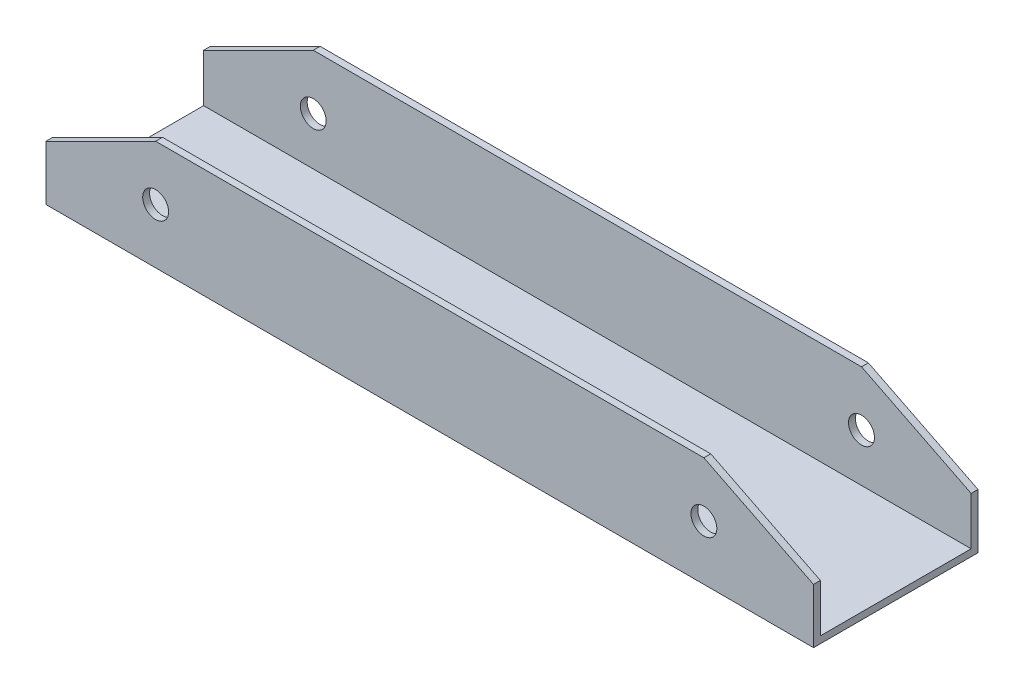
ISO-10303-21;
HEADER;
FILE_DESCRIPTION(('STEP AP214'),'2;1');
FILE_NAME('part.step','',(''),(''),'','','');
FILE_SCHEMA(('AUTOMOTIVE_DESIGN { 1 0 10303 214 1 1 1 1 }'));
ENDSEC;
DATA;
#1=APPLICATION_CONTEXT('core data for automotive mechanical design processes');
#2=APPLICATION_PROTOCOL_DEFINITION('international standard','automotive_design',2000,#1);
#3=PRODUCT_CONTEXT('',#1,'mechanical');
#4=PRODUCT('Part','Part','',(#3));
#5=PRODUCT_RELATED_PRODUCT_CATEGORY('part','',(#4));
#6=PRODUCT_DEFINITION_FORMATION('','',#4);
#7=PRODUCT_DEFINITION_CONTEXT('part definition',#1,'design');
#8=PRODUCT_DEFINITION('design','',#6,#7);
#9=PRODUCT_DEFINITION_SHAPE('','',#8);
#10=(LENGTH_UNIT() NAMED_UNIT(*) SI_UNIT(.MILLI.,.METRE.));
#11=(NAMED_UNIT(*) PLANE_ANGLE_UNIT() SI_UNIT($,.RADIAN.));
#12=(NAMED_UNIT(*) SI_UNIT($,.STERADIAN.) SOLID_ANGLE_UNIT());
#13=UNCERTAINTY_MEASURE_WITH_UNIT(LENGTH_MEASURE(1.E-05),#10,'distance_accuracy_value','');
#14=(GEOMETRIC_REPRESENTATION_CONTEXT(3) GLOBAL_UNCERTAINTY_ASSIGNED_CONTEXT((#13)) GLOBAL_UNIT_ASSIGNED_CONTEXT((#10,
#11,#12)) REPRESENTATION_CONTEXT('',''));
#15=CARTESIAN_POINT('',(0.,0.,0.));
#16=DIRECTION('',(0.,0.,1.));
#17=DIRECTION('',(1.,0.,0.));
#18=AXIS2_PLACEMENT_3D('',#15,#16,#17);
#19=CARTESIAN_POINT('',(0.,0.,0.));
#20=DIRECTION('',(-1.,0.,0.));
#21=DIRECTION('',(0.,0.,1.));
#22=AXIS2_PLACEMENT_3D('',#19,#20,#21);
#23=PLANE('',#22);
#24=DIRECTION('',(0.,0.,1.));
#25=VECTOR('',#24,1.);
#26=CARTESIAN_POINT('',(0.,12.7,-228.6));
#27=LINE('',#26,#25);
#28=CARTESIAN_POINT('',(0.,12.7,-38.1));
#29=VERTEX_POINT('',#28);
#30=CARTESIAN_POINT('',(0.,12.7,-36.5125));
#31=VERTEX_POINT('',#30);
#32=EDGE_CURVE('E51',#29,#31,#27,.T.);
#33=ORIENTED_EDGE('',*,*,#32,.F.);
#34=DIRECTION('',(0.,1.,0.));
#35=VECTOR('',#34,1.);
#36=CARTESIAN_POINT('',(0.,0.,-38.1));
#37=LINE('',#36,#35);
#38=CARTESIAN_POINT('',(0.,0.,-38.1));
#39=VERTEX_POINT('',#38);
#40=EDGE_CURVE('E153',#39,#29,#37,.T.);
#41=ORIENTED_EDGE('',*,*,#40,.F.);
#42=DIRECTION('',(0.,0.,-1.));
#43=VECTOR('',#42,1.);
#44=CARTESIAN_POINT('',(0.,0.,0.));
#45=LINE('',#44,#43);
#46=CARTESIAN_POINT('',(0.,0.,0.));
#47=VERTEX_POINT('',#46);
#48=EDGE_CURVE('E150',#47,#39,#45,.T.);
#49=ORIENTED_EDGE('',*,*,#48,.F.);
#50=DIRECTION('',(0.,-1.,0.));
#51=VECTOR('',#50,1.);
#52=CARTESIAN_POINT('',(0.,0.,0.));
#53=LINE('',#52,#51);
#54=CARTESIAN_POINT('',(0.,12.7,0.));
#55=VERTEX_POINT('',#54);
#56=EDGE_CURVE('E141',#55,#47,#53,.T.);
#57=ORIENTED_EDGE('',*,*,#56,.F.);
#58=CARTESIAN_POINT('',(0.,12.7,-1.58749999999999));
#59=VERTEX_POINT('',#58);
#60=EDGE_CURVE('E126',#59,#55,#27,.T.);
#61=ORIENTED_EDGE('',*,*,#60,.F.);
#62=DIRECTION('',(0.,-1.,0.));
#63=VECTOR('',#62,1.);
#64=CARTESIAN_POINT('',(0.,1.5875,-1.5875));
#65=LINE('',#64,#63);
#66=CARTESIAN_POINT('',(0.,1.5875,-1.5875));
#67=VERTEX_POINT('',#66);
#68=EDGE_CURVE('E192',#59,#67,#65,.T.);
#69=ORIENTED_EDGE('',*,*,#68,.T.);
#70=DIRECTION('',(0.,0.,-1.));
#71=VECTOR('',#70,1.);
#72=CARTESIAN_POINT('',(0.,1.5875,-1.5875));
#73=LINE('',#72,#71);
#74=CARTESIAN_POINT('',(0.,1.5875,-36.5125));
#75=VERTEX_POINT('',#74);
#76=EDGE_CURVE('E194',#67,#75,#73,.T.);
#77=ORIENTED_EDGE('',*,*,#76,.T.);
#78=DIRECTION('',(0.,1.,0.));
#79=VECTOR('',#78,1.);
#80=CARTESIAN_POINT('',(0.,1.5875,-36.5125));
#81=LINE('',#80,#79);
#82=EDGE_CURVE('E197',#75,#31,#81,.T.);
#83=ORIENTED_EDGE('',*,*,#82,.T.);
#84=EDGE_LOOP('',(#33,#41,#49,#57,#61,#69,#77,#83));
#85=FACE_BOUND('',#84,.T.);
#86=ADVANCED_FACE('F34',(#85),#23,.T.);
#87=CARTESIAN_POINT('',(228.6,0.,0.));
#88=DIRECTION('',(0.,0.,-1.));
#89=DIRECTION('',(-1.,0.,0.));
#90=AXIS2_PLACEMENT_3D('',#87,#88,#89);
#91=PLANE('',#90);
#92=CARTESIAN_POINT('',(152.4,12.7,0.));
#93=DIRECTION('',(0.,0.,1.));
#94=DIRECTION('',(1.,0.,0.));
#95=AXIS2_PLACEMENT_3D('',#92,#93,#94);
#96=CIRCLE('',#95,2.99999999999999);
#97=CARTESIAN_POINT('',(155.4,12.7,0.));
#98=VERTEX_POINT('',#97);
#99=EDGE_CURVE('E267',#98,#98,#96,.T.);
#100=ORIENTED_EDGE('',*,*,#99,.F.);
#101=EDGE_LOOP('',(#100));
#102=FACE_BOUND('',#101,.T.);
#103=CARTESIAN_POINT('',(25.4,12.7,0.));
#104=DIRECTION('',(0.,0.,1.));
#105=DIRECTION('',(1.,0.,0.));
#106=AXIS2_PLACEMENT_3D('',#103,#104,#105);
#107=CIRCLE('',#106,3.);
#108=CARTESIAN_POINT('',(28.4,12.7,0.));
#109=VERTEX_POINT('',#108);
#110=EDGE_CURVE('E146',#109,#109,#107,.T.);
#111=ORIENTED_EDGE('',*,*,#110,.F.);
#112=EDGE_LOOP('',(#111));
#113=FACE_BOUND('',#112,.T.);
#114=DIRECTION('',(-1.,0.,0.));
#115=VECTOR('',#114,1.);
#116=CARTESIAN_POINT('',(228.6,0.,0.));
#117=LINE('',#116,#115);
#118=CARTESIAN_POINT('',(177.8,0.,0.));
#119=VERTEX_POINT('',#118);
#120=EDGE_CURVE('E162',#119,#47,#117,.T.);
#121=ORIENTED_EDGE('',*,*,#120,.F.);
#122=DIRECTION('',(0.,-1.,0.));
#123=VECTOR('',#122,1.);
#124=CARTESIAN_POINT('',(177.8,12.7,0.));
#125=LINE('',#124,#123);
#126=CARTESIAN_POINT('',(177.8,12.7,0.));
#127=VERTEX_POINT('',#126);
#128=EDGE_CURVE('E137',#127,#119,#125,.T.);
#129=ORIENTED_EDGE('',*,*,#128,.F.);
#130=DIRECTION('',(0.894427190999916,-0.447213595499958,0.));
#131=VECTOR('',#130,1.);
#132=CARTESIAN_POINT('',(152.4,25.4,0.));
#133=LINE('',#132,#131);
#134=CARTESIAN_POINT('',(152.4,25.4,0.));
#135=VERTEX_POINT('',#134);
#136=EDGE_CURVE('E225',#135,#127,#133,.T.);
#137=ORIENTED_EDGE('',*,*,#136,.F.);
#138=DIRECTION('',(1.,0.,0.));
#139=VECTOR('',#138,1.);
#140=CARTESIAN_POINT('',(25.4,25.4,0.));
#141=LINE('',#140,#139);
#142=CARTESIAN_POINT('',(25.4,25.4,0.));
#143=VERTEX_POINT('',#142);
#144=EDGE_CURVE('E145',#143,#135,#141,.T.);
#145=ORIENTED_EDGE('',*,*,#144,.F.);
#146=DIRECTION('',(0.894427190999916,0.447213595499958,0.));
#147=VECTOR('',#146,1.);
#148=CARTESIAN_POINT('',(0.,12.7,0.));
#149=LINE('',#148,#147);
#150=EDGE_CURVE('E130',#55,#143,#149,.T.);
#151=ORIENTED_EDGE('',*,*,#150,.F.);
#152=ORIENTED_EDGE('',*,*,#56,.T.);
#153=EDGE_LOOP('',(#121,#129,#137,#145,#151,#152));
#154=FACE_BOUND('',#153,.T.);
#155=ADVANCED_FACE('F36',(#102,#113,#154),#91,.F.);
#156=CARTESIAN_POINT('',(228.6,0.,0.));
#157=DIRECTION('',(0.,1.,0.));
#158=DIRECTION('',(0.,0.,1.));
#159=AXIS2_PLACEMENT_3D('',#156,#157,#158);
#160=PLANE('',#159);
#161=DIRECTION('',(-1.,0.,0.));
#162=VECTOR('',#161,1.);
#163=CARTESIAN_POINT('',(228.6,0.,-38.1));
#164=LINE('',#163,#162);
#165=CARTESIAN_POINT('',(177.8,0.,-38.1));
#166=VERTEX_POINT('',#165);
#167=EDGE_CURVE('E59',#166,#39,#164,.T.);
#168=ORIENTED_EDGE('',*,*,#167,.F.);
#169=DIRECTION('',(0.,0.,1.));
#170=VECTOR('',#169,1.);
#171=CARTESIAN_POINT('',(177.8,0.,-228.6));
#172=LINE('',#171,#170);
#173=EDGE_CURVE('E230',#166,#119,#172,.T.);
#174=ORIENTED_EDGE('',*,*,#173,.T.);
#175=ORIENTED_EDGE('',*,*,#120,.T.);
#176=ORIENTED_EDGE('',*,*,#48,.T.);
#177=EDGE_LOOP('',(#168,#174,#175,#176));
#178=FACE_BOUND('',#177,.T.);
#179=ADVANCED_FACE('F263',(#178),#160,.F.);
#180=CARTESIAN_POINT('',(228.6,0.,-38.1));
#181=DIRECTION('',(0.,0.,1.));
#182=DIRECTION('',(0.,-1.,0.));
#183=AXIS2_PLACEMENT_3D('',#180,#181,#182);
#184=PLANE('',#183);
#185=CARTESIAN_POINT('',(152.4,12.7,-38.1));
#186=DIRECTION('',(0.,0.,1.));
#187=DIRECTION('',(0.,-1.,0.));
#188=AXIS2_PLACEMENT_3D('',#185,#186,#187);
#189=CIRCLE('',#188,2.99999999999999);
#190=CARTESIAN_POINT('',(152.4,9.7,-38.1));
#191=VERTEX_POINT('',#190);
#192=EDGE_CURVE('E189',#191,#191,#189,.T.);
#193=ORIENTED_EDGE('',*,*,#192,.T.);
#194=EDGE_LOOP('',(#193));
#195=FACE_BOUND('',#194,.T.);
#196=CARTESIAN_POINT('',(25.4,12.7,-38.1));
#197=DIRECTION('',(0.,0.,1.));
#198=DIRECTION('',(0.,-1.,0.));
#199=AXIS2_PLACEMENT_3D('',#196,#197,#198);
#200=CIRCLE('',#199,3.);
#201=CARTESIAN_POINT('',(25.4,9.7,-38.1));
#202=VERTEX_POINT('',#201);
#203=EDGE_CURVE('E175',#202,#202,#200,.T.);
#204=ORIENTED_EDGE('',*,*,#203,.T.);
#205=EDGE_LOOP('',(#204));
#206=FACE_BOUND('',#205,.T.);
#207=DIRECTION('',(0.894427190999916,-0.447213595499958,0.));
#208=VECTOR('',#207,1.);
#209=CARTESIAN_POINT('',(223.52,-10.16,-38.1));
#210=LINE('',#209,#208);
#211=CARTESIAN_POINT('',(152.4,25.4,-38.1));
#212=VERTEX_POINT('',#211);
#213=CARTESIAN_POINT('',(177.8,12.7,-38.1));
#214=VERTEX_POINT('',#213);
#215=EDGE_CURVE('E250',#212,#214,#210,.T.);
#216=ORIENTED_EDGE('',*,*,#215,.T.);
#217=DIRECTION('',(0.,-1.,0.));
#218=VECTOR('',#217,1.);
#219=CARTESIAN_POINT('',(177.8,0.,-38.1));
#220=LINE('',#219,#218);
#221=EDGE_CURVE('E171',#214,#166,#220,.T.);
#222=ORIENTED_EDGE('',*,*,#221,.T.);
#223=ORIENTED_EDGE('',*,*,#167,.T.);
#224=ORIENTED_EDGE('',*,*,#40,.T.);
#225=DIRECTION('',(0.894427190999916,0.447213595499958,0.));
#226=VECTOR('',#225,1.);
#227=CARTESIAN_POINT('',(177.8,101.6,-38.1));
#228=LINE('',#227,#226);
#229=CARTESIAN_POINT('',(25.4,25.4,-38.1));
#230=VERTEX_POINT('',#229);
#231=EDGE_CURVE('E241',#29,#230,#228,.T.);
#232=ORIENTED_EDGE('',*,*,#231,.T.);
#233=DIRECTION('',(1.,0.,0.));
#234=VECTOR('',#233,1.);
#235=CARTESIAN_POINT('',(228.6,25.4,-38.1));
#236=LINE('',#235,#234);
#237=EDGE_CURVE('E246',#230,#212,#236,.T.);
#238=ORIENTED_EDGE('',*,*,#237,.T.);
#239=EDGE_LOOP('',(#216,#222,#223,#224,#232,#238));
#240=FACE_BOUND('',#239,.T.);
#241=ADVANCED_FACE('F251',(#195,#206,#240),#184,.F.);
#242=CARTESIAN_POINT('',(228.6,1.5875,-1.5875));
#243=DIRECTION('',(0.,0.,-1.));
#244=DIRECTION('',(-1.,0.,0.));
#245=AXIS2_PLACEMENT_3D('',#242,#243,#244);
#246=PLANE('',#245);
#247=CARTESIAN_POINT('',(152.4,12.7,-1.58749999999999));
#248=DIRECTION('',(0.,0.,-1.));
#249=DIRECTION('',(-1.,0.,0.));
#250=AXIS2_PLACEMENT_3D('',#247,#248,#249);
#251=CIRCLE('',#250,2.99999999999999);
#252=CARTESIAN_POINT('',(149.4,12.7,-1.58749999999999));
#253=VERTEX_POINT('',#252);
#254=EDGE_CURVE('E186',#253,#253,#251,.T.);
#255=ORIENTED_EDGE('',*,*,#254,.F.);
#256=EDGE_LOOP('',(#255));
#257=FACE_BOUND('',#256,.T.);
#258=CARTESIAN_POINT('',(25.4,12.7,-1.58749999999999));
#259=DIRECTION('',(0.,0.,-1.));
#260=DIRECTION('',(-1.,0.,0.));
#261=AXIS2_PLACEMENT_3D('',#258,#259,#260);
#262=CIRCLE('',#261,3.);
#263=CARTESIAN_POINT('',(22.4,12.7,-1.58749999999999));
#264=VERTEX_POINT('',#263);
#265=EDGE_CURVE('E170',#264,#264,#262,.T.);
#266=ORIENTED_EDGE('',*,*,#265,.F.);
#267=EDGE_LOOP('',(#266));
#268=FACE_BOUND('',#267,.T.);
#269=DIRECTION('',(0.,1.,0.));
#270=VECTOR('',#269,1.);
#271=CARTESIAN_POINT('',(177.8,1.5875,-1.5875));
#272=LINE('',#271,#270);
#273=CARTESIAN_POINT('',(177.8,1.5875,-1.5875));
#274=VERTEX_POINT('',#273);
#275=CARTESIAN_POINT('',(177.8,12.7,-1.58749999999999));
#276=VERTEX_POINT('',#275);
#277=EDGE_CURVE('E177',#274,#276,#272,.T.);
#278=ORIENTED_EDGE('',*,*,#277,.F.);
#279=DIRECTION('',(-1.,0.,0.));
#280=VECTOR('',#279,1.);
#281=CARTESIAN_POINT('',(228.6,1.5875,-1.5875));
#282=LINE('',#281,#280);
#283=EDGE_CURVE('E151',#274,#67,#282,.T.);
#284=ORIENTED_EDGE('',*,*,#283,.T.);
#285=ORIENTED_EDGE('',*,*,#68,.F.);
#286=DIRECTION('',(-0.894427190999916,-0.447213595499958,0.));
#287=VECTOR('',#286,1.);
#288=CARTESIAN_POINT('',(178.435,101.9175,-1.5875));
#289=LINE('',#288,#287);
#290=CARTESIAN_POINT('',(25.4,25.4,-1.58749999999999));
#291=VERTEX_POINT('',#290);
#292=EDGE_CURVE('E133',#291,#59,#289,.T.);
#293=ORIENTED_EDGE('',*,*,#292,.F.);
#294=DIRECTION('',(-1.,0.,0.));
#295=VECTOR('',#294,1.);
#296=CARTESIAN_POINT('',(228.6,25.4,-1.5875));
#297=LINE('',#296,#295);
#298=CARTESIAN_POINT('',(152.4,25.4,-1.58749999999999));
#299=VERTEX_POINT('',#298);
#300=EDGE_CURVE('E244',#299,#291,#297,.T.);
#301=ORIENTED_EDGE('',*,*,#300,.F.);
#302=DIRECTION('',(-0.894427190999916,0.447213595499958,0.));
#303=VECTOR('',#302,1.);
#304=CARTESIAN_POINT('',(222.885,-9.84249999999998,-1.5875));
#305=LINE('',#304,#303);
#306=EDGE_CURVE('E215',#276,#299,#305,.T.);
#307=ORIENTED_EDGE('',*,*,#306,.F.);
#308=EDGE_LOOP('',(#278,#284,#285,#293,#301,#307));
#309=FACE_BOUND('',#308,.T.);
#310=ADVANCED_FACE('F212',(#257,#268,#309),#246,.T.);
#311=CARTESIAN_POINT('',(228.6,1.5875,-1.5875));
#312=DIRECTION('',(0.,1.,0.));
#313=DIRECTION('',(0.,0.,1.));
#314=AXIS2_PLACEMENT_3D('',#311,#312,#313);
#315=PLANE('',#314);
#316=DIRECTION('',(0.,0.,1.));
#317=VECTOR('',#316,1.);
#318=CARTESIAN_POINT('',(177.8,1.5875,-1.5875));
#319=LINE('',#318,#317);
#320=CARTESIAN_POINT('',(177.8,1.5875,-36.5125));
#321=VERTEX_POINT('',#320);
#322=EDGE_CURVE('E180',#321,#274,#319,.T.);
#323=ORIENTED_EDGE('',*,*,#322,.F.);
#324=DIRECTION('',(-1.,0.,0.));
#325=VECTOR('',#324,1.);
#326=CARTESIAN_POINT('',(228.6,1.5875,-36.5125));
#327=LINE('',#326,#325);
#328=EDGE_CURVE('E156',#321,#75,#327,.T.);
#329=ORIENTED_EDGE('',*,*,#328,.T.);
#330=ORIENTED_EDGE('',*,*,#76,.F.);
#331=ORIENTED_EDGE('',*,*,#283,.F.);
#332=EDGE_LOOP('',(#323,#329,#330,#331));
#333=FACE_BOUND('',#332,.T.);
#334=ADVANCED_FACE('F204',(#333),#315,.T.);
#335=CARTESIAN_POINT('',(228.6,1.5875,-36.5125));
#336=DIRECTION('',(0.,0.,1.));
#337=DIRECTION('',(1.,0.,0.));
#338=AXIS2_PLACEMENT_3D('',#335,#336,#337);
#339=PLANE('',#338);
#340=CARTESIAN_POINT('',(152.4,12.7,-36.5125));
#341=DIRECTION('',(0.,0.,1.));
#342=DIRECTION('',(1.,0.,0.));
#343=AXIS2_PLACEMENT_3D('',#340,#341,#342);
#344=CIRCLE('',#343,2.99999999999999);
#345=CARTESIAN_POINT('',(155.4,12.7,-36.5125));
#346=VERTEX_POINT('',#345);
#347=EDGE_CURVE('E38',#346,#346,#344,.T.);
#348=ORIENTED_EDGE('',*,*,#347,.F.);
#349=EDGE_LOOP('',(#348));
#350=FACE_BOUND('',#349,.T.);
#351=CARTESIAN_POINT('',(25.4,12.7,-36.5125));
#352=DIRECTION('',(0.,0.,1.));
#353=DIRECTION('',(1.,0.,0.));
#354=AXIS2_PLACEMENT_3D('',#351,#352,#353);
#355=CIRCLE('',#354,3.);
#356=CARTESIAN_POINT('',(28.4,12.7,-36.5125));
#357=VERTEX_POINT('',#356);
#358=EDGE_CURVE('E168',#357,#357,#355,.T.);
#359=ORIENTED_EDGE('',*,*,#358,.F.);
#360=EDGE_LOOP('',(#359));
#361=FACE_BOUND('',#360,.T.);
#362=DIRECTION('',(0.,-1.,0.));
#363=VECTOR('',#362,1.);
#364=CARTESIAN_POINT('',(177.8,1.5875,-36.5125));
#365=LINE('',#364,#363);
#366=CARTESIAN_POINT('',(177.8,12.7,-36.5125));
#367=VERTEX_POINT('',#366);
#368=EDGE_CURVE('E11',#367,#321,#365,.T.);
#369=ORIENTED_EDGE('',*,*,#368,.F.);
#370=DIRECTION('',(0.894427190999916,-0.447213595499958,0.));
#371=VECTOR('',#370,1.);
#372=CARTESIAN_POINT('',(222.885,-9.84249999999998,-36.5125));
#373=LINE('',#372,#371);
#374=CARTESIAN_POINT('',(152.4,25.4,-36.5125));
#375=VERTEX_POINT('',#374);
#376=EDGE_CURVE('E43',#375,#367,#373,.T.);
#377=ORIENTED_EDGE('',*,*,#376,.F.);
#378=DIRECTION('',(1.,0.,0.));
#379=VECTOR('',#378,1.);
#380=CARTESIAN_POINT('',(228.6,25.4,-36.5125));
#381=LINE('',#380,#379);
#382=CARTESIAN_POINT('',(25.4,25.4,-36.5125));
#383=VERTEX_POINT('',#382);
#384=EDGE_CURVE('E166',#383,#375,#381,.T.);
#385=ORIENTED_EDGE('',*,*,#384,.F.);
#386=DIRECTION('',(0.894427190999916,0.447213595499958,0.));
#387=VECTOR('',#386,1.);
#388=CARTESIAN_POINT('',(178.435,101.9175,-36.5125));
#389=LINE('',#388,#387);
#390=EDGE_CURVE('E164',#31,#383,#389,.T.);
#391=ORIENTED_EDGE('',*,*,#390,.F.);
#392=ORIENTED_EDGE('',*,*,#82,.F.);
#393=ORIENTED_EDGE('',*,*,#328,.F.);
#394=EDGE_LOOP('',(#369,#377,#385,#391,#392,#393));
#395=FACE_BOUND('',#394,.T.);
#396=ADVANCED_FACE('F208',(#350,#361,#395),#339,.T.);
#397=CARTESIAN_POINT('',(177.8,12.7,-228.6));
#398=DIRECTION('',(-1.,0.,0.));
#399=DIRECTION('',(0.,0.,1.));
#400=AXIS2_PLACEMENT_3D('',#397,#398,#399);
#401=PLANE('',#400);
#402=DIRECTION('',(0.,0.,1.));
#403=VECTOR('',#402,1.);
#404=CARTESIAN_POINT('',(177.8,12.7,-228.6));
#405=LINE('',#404,#403);
#406=EDGE_CURVE('E227',#214,#367,#405,.T.);
#407=ORIENTED_EDGE('',*,*,#406,.T.);
#408=ORIENTED_EDGE('',*,*,#368,.T.);
#409=ORIENTED_EDGE('',*,*,#322,.T.);
#410=ORIENTED_EDGE('',*,*,#277,.T.);
#411=EDGE_CURVE('E220',#276,#127,#405,.T.);
#412=ORIENTED_EDGE('',*,*,#411,.T.);
#413=ORIENTED_EDGE('',*,*,#128,.T.);
#414=ORIENTED_EDGE('',*,*,#173,.F.);
#415=ORIENTED_EDGE('',*,*,#221,.F.);
#416=EDGE_LOOP('',(#407,#408,#409,#410,#412,#413,#414,#415));
#417=FACE_BOUND('',#416,.T.);
#418=ADVANCED_FACE('F219',(#417),#401,.F.);
#419=CARTESIAN_POINT('',(152.4,25.4,-228.6));
#420=DIRECTION('',(-0.447213595499958,-0.894427190999916,0.));
#421=DIRECTION('',(0.894427190999916,-0.447213595499958,0.));
#422=AXIS2_PLACEMENT_3D('',#419,#420,#421);
#423=PLANE('',#422);
#424=DIRECTION('',(0.,0.,1.));
#425=VECTOR('',#424,1.);
#426=CARTESIAN_POINT('',(152.4,25.4,-228.6));
#427=LINE('',#426,#425);
#428=EDGE_CURVE('E228',#212,#375,#427,.T.);
#429=ORIENTED_EDGE('',*,*,#428,.T.);
#430=ORIENTED_EDGE('',*,*,#376,.T.);
#431=ORIENTED_EDGE('',*,*,#406,.F.);
#432=ORIENTED_EDGE('',*,*,#215,.F.);
#433=EDGE_LOOP('',(#429,#430,#431,#432));
#434=FACE_BOUND('',#433,.T.);
#435=ADVANCED_FACE('F255',(#434),#423,.F.);
#436=ORIENTED_EDGE('',*,*,#306,.T.);
#437=EDGE_CURVE('E232',#299,#135,#427,.T.);
#438=ORIENTED_EDGE('',*,*,#437,.T.);
#439=ORIENTED_EDGE('',*,*,#136,.T.);
#440=ORIENTED_EDGE('',*,*,#411,.F.);
#441=EDGE_LOOP('',(#436,#438,#439,#440));
#442=FACE_BOUND('',#441,.T.);
#443=ADVANCED_FACE('F223',(#442),#423,.F.);
#444=CARTESIAN_POINT('',(25.4,25.4,-228.6));
#445=DIRECTION('',(0.,-1.,0.));
#446=DIRECTION('',(0.,0.,-1.));
#447=AXIS2_PLACEMENT_3D('',#444,#445,#446);
#448=PLANE('',#447);
#449=DIRECTION('',(0.,0.,1.));
#450=VECTOR('',#449,1.);
#451=CARTESIAN_POINT('',(25.4,25.4,-228.6));
#452=LINE('',#451,#450);
#453=EDGE_CURVE('E237',#230,#383,#452,.T.);
#454=ORIENTED_EDGE('',*,*,#453,.T.);
#455=ORIENTED_EDGE('',*,*,#384,.T.);
#456=ORIENTED_EDGE('',*,*,#428,.F.);
#457=ORIENTED_EDGE('',*,*,#237,.F.);
#458=EDGE_LOOP('',(#454,#455,#456,#457));
#459=FACE_BOUND('',#458,.T.);
#460=ADVANCED_FACE('F259',(#459),#448,.F.);
#461=ORIENTED_EDGE('',*,*,#300,.T.);
#462=EDGE_CURVE('E238',#291,#143,#452,.T.);
#463=ORIENTED_EDGE('',*,*,#462,.T.);
#464=ORIENTED_EDGE('',*,*,#144,.T.);
#465=ORIENTED_EDGE('',*,*,#437,.F.);
#466=EDGE_LOOP('',(#461,#463,#464,#465));
#467=FACE_BOUND('',#466,.T.);
#468=ADVANCED_FACE('F325',(#467),#448,.F.);
#469=CARTESIAN_POINT('',(0.,12.7,-228.6));
#470=DIRECTION('',(0.447213595499958,-0.894427190999916,0.));
#471=DIRECTION('',(0.894427190999916,0.447213595499958,0.));
#472=AXIS2_PLACEMENT_3D('',#469,#470,#471);
#473=PLANE('',#472);
#474=ORIENTED_EDGE('',*,*,#32,.T.);
#475=ORIENTED_EDGE('',*,*,#390,.T.);
#476=ORIENTED_EDGE('',*,*,#453,.F.);
#477=ORIENTED_EDGE('',*,*,#231,.F.);
#478=EDGE_LOOP('',(#474,#475,#476,#477));
#479=FACE_BOUND('',#478,.T.);
#480=ADVANCED_FACE('F322',(#479),#473,.F.);
#481=ORIENTED_EDGE('',*,*,#292,.T.);
#482=ORIENTED_EDGE('',*,*,#60,.T.);
#483=ORIENTED_EDGE('',*,*,#150,.T.);
#484=ORIENTED_EDGE('',*,*,#462,.F.);
#485=EDGE_LOOP('',(#481,#482,#483,#484));
#486=FACE_BOUND('',#485,.T.);
#487=ADVANCED_FACE('F128',(#486),#473,.F.);
#488=CARTESIAN_POINT('',(25.4,12.7,-228.6));
#489=DIRECTION('',(0.,0.,1.));
#490=DIRECTION('',(1.,0.,0.));
#491=AXIS2_PLACEMENT_3D('',#488,#489,#490);
#492=CYLINDRICAL_SURFACE('',#491,3.);
#493=ORIENTED_EDGE('',*,*,#358,.T.);
#494=EDGE_LOOP('',(#493));
#495=FACE_BOUND('',#494,.T.);
#496=ORIENTED_EDGE('',*,*,#203,.F.);
#497=EDGE_LOOP('',(#496));
#498=FACE_BOUND('',#497,.T.);
#499=ADVANCED_FACE('F294',(#495,#498),#492,.F.);
#500=CARTESIAN_POINT('',(152.4,12.7,-228.6));
#501=DIRECTION('',(0.,0.,1.));
#502=DIRECTION('',(1.,0.,0.));
#503=AXIS2_PLACEMENT_3D('',#500,#501,#502);
#504=CYLINDRICAL_SURFACE('',#503,2.99999999999999);
#505=ORIENTED_EDGE('',*,*,#347,.T.);
#506=EDGE_LOOP('',(#505));
#507=FACE_BOUND('',#506,.T.);
#508=ORIENTED_EDGE('',*,*,#192,.F.);
#509=EDGE_LOOP('',(#508));
#510=FACE_BOUND('',#509,.T.);
#511=ADVANCED_FACE('F288',(#507,#510),#504,.F.);
#512=ORIENTED_EDGE('',*,*,#265,.T.);
#513=EDGE_LOOP('',(#512));
#514=FACE_BOUND('',#513,.T.);
#515=ORIENTED_EDGE('',*,*,#110,.T.);
#516=EDGE_LOOP('',(#515));
#517=FACE_BOUND('',#516,.T.);
#518=ADVANCED_FACE('F273',(#514,#517),#492,.F.);
#519=ORIENTED_EDGE('',*,*,#254,.T.);
#520=EDGE_LOOP('',(#519));
#521=FACE_BOUND('',#520,.T.);
#522=ORIENTED_EDGE('',*,*,#99,.T.);
#523=EDGE_LOOP('',(#522));
#524=FACE_BOUND('',#523,.T.);
#525=ADVANCED_FACE('F284',(#521,#524),#504,.F.);
#526=CLOSED_SHELL('',(#86,#155,#179,#241,#310,#334,#396,#418,#435,#443,#460,#468,#480,#487,#499,
#511,#518,#525));
#527=MANIFOLD_SOLID_BREP('B2',#526);
#528=ADVANCED_BREP_SHAPE_REPRESENTATION('',(#18,#527),#14);
#529=SHAPE_DEFINITION_REPRESENTATION(#9,#528);
ENDSEC;
END-ISO-10303-21;
